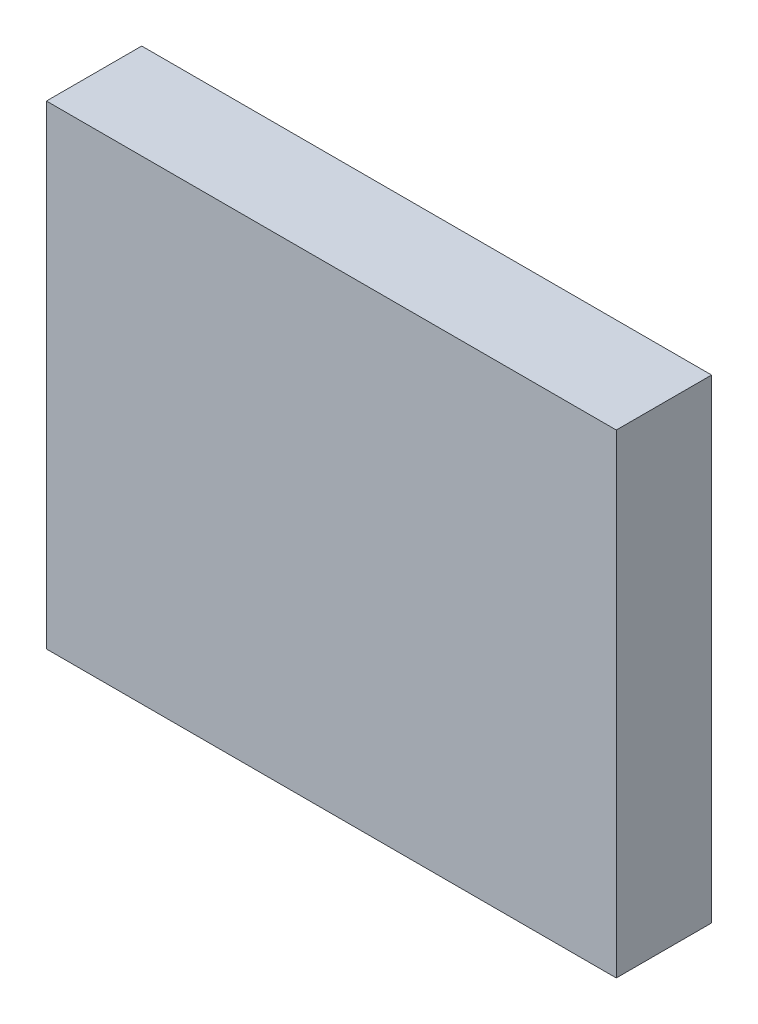
ISO-10303-21;
HEADER;
FILE_DESCRIPTION(('STEP AP214'),'2;1');
FILE_NAME('part.step','',(''),(''),'','','');
FILE_SCHEMA(('AUTOMOTIVE_DESIGN { 1 0 10303 214 1 1 1 1 }'));
ENDSEC;
DATA;
#1=APPLICATION_CONTEXT('core data for automotive mechanical design processes');
#2=APPLICATION_PROTOCOL_DEFINITION('international standard','automotive_design',2000,#1);
#3=PRODUCT_CONTEXT('',#1,'mechanical');
#4=PRODUCT('Part','Part','',(#3));
#5=PRODUCT_RELATED_PRODUCT_CATEGORY('part','',(#4));
#6=PRODUCT_DEFINITION_FORMATION('','',#4);
#7=PRODUCT_DEFINITION_CONTEXT('part definition',#1,'design');
#8=PRODUCT_DEFINITION('design','',#6,#7);
#9=PRODUCT_DEFINITION_SHAPE('','',#8);
#10=(LENGTH_UNIT() NAMED_UNIT(*) SI_UNIT(.MILLI.,.METRE.));
#11=(NAMED_UNIT(*) PLANE_ANGLE_UNIT() SI_UNIT($,.RADIAN.));
#12=(NAMED_UNIT(*) SI_UNIT($,.STERADIAN.) SOLID_ANGLE_UNIT());
#13=UNCERTAINTY_MEASURE_WITH_UNIT(LENGTH_MEASURE(1.E-05),#10,'distance_accuracy_value','');
#14=(GEOMETRIC_REPRESENTATION_CONTEXT(3) GLOBAL_UNCERTAINTY_ASSIGNED_CONTEXT((#13)) GLOBAL_UNIT_ASSIGNED_CONTEXT((#10,
#11,#12)) REPRESENTATION_CONTEXT('',''));
#15=CARTESIAN_POINT('',(0.,0.,0.));
#16=DIRECTION('',(0.,0.,1.));
#17=DIRECTION('',(1.,0.,0.));
#18=AXIS2_PLACEMENT_3D('',#15,#16,#17);
#19=CARTESIAN_POINT('',(-1.003,-0.127,0.));
#20=DIRECTION('',(0.,-1.,0.));
#21=DIRECTION('',(0.,0.,1.));
#22=AXIS2_PLACEMENT_3D('',#19,#20,#21);
#23=PLANE('',#22);
#24=DIRECTION('',(-1.,0.,0.));
#25=VECTOR('',#24,1.);
#26=CARTESIAN_POINT('',(-0.698,-0.127,0.));
#27=LINE('',#26,#25);
#28=CARTESIAN_POINT('',(-0.698,-0.127,0.));
#29=VERTEX_POINT('',#28);
#30=CARTESIAN_POINT('',(-1.003,-0.127,0.));
#31=VERTEX_POINT('',#30);
#32=EDGE_CURVE('E11',#29,#31,#27,.T.);
#33=ORIENTED_EDGE('',*,*,#32,.F.);
#34=DIRECTION('',(0.,0.,-1.));
#35=VECTOR('',#34,1.);
#36=CARTESIAN_POINT('',(-0.698,-0.127,0.051));
#37=LINE('',#36,#35);
#38=CARTESIAN_POINT('',(-0.698,-0.127,0.051));
#39=VERTEX_POINT('',#38);
#40=EDGE_CURVE('E24',#39,#29,#37,.T.);
#41=ORIENTED_EDGE('',*,*,#40,.F.);
#42=DIRECTION('',(1.,0.,0.));
#43=VECTOR('',#42,1.);
#44=CARTESIAN_POINT('',(-1.003,-0.127,0.051));
#45=LINE('',#44,#43);
#46=CARTESIAN_POINT('',(-1.003,-0.127,0.051));
#47=VERTEX_POINT('',#46);
#48=EDGE_CURVE('E88',#47,#39,#45,.T.);
#49=ORIENTED_EDGE('',*,*,#48,.F.);
#50=DIRECTION('',(0.,0.,1.));
#51=VECTOR('',#50,1.);
#52=CARTESIAN_POINT('',(-1.003,-0.127,0.));
#53=LINE('',#52,#51);
#54=EDGE_CURVE('E77',#31,#47,#53,.T.);
#55=ORIENTED_EDGE('',*,*,#54,.F.);
#56=EDGE_LOOP('',(#33,#41,#49,#55));
#57=FACE_BOUND('',#56,.T.);
#58=ADVANCED_FACE('F17',(#57),#23,.T.);
#59=CARTESIAN_POINT('',(-0.698,-0.127,0.));
#60=DIRECTION('',(1.,0.,0.));
#61=DIRECTION('',(0.,0.,1.));
#62=AXIS2_PLACEMENT_3D('',#59,#60,#61);
#63=PLANE('',#62);
#64=DIRECTION('',(0.,-1.,0.));
#65=VECTOR('',#64,1.);
#66=CARTESIAN_POINT('',(-0.698,0.127,0.));
#67=LINE('',#66,#65);
#68=CARTESIAN_POINT('',(-0.698,0.127,0.));
#69=VERTEX_POINT('',#68);
#70=EDGE_CURVE('E85',#69,#29,#67,.T.);
#71=ORIENTED_EDGE('',*,*,#70,.F.);
#72=DIRECTION('',(0.,0.,-1.));
#73=VECTOR('',#72,1.);
#74=CARTESIAN_POINT('',(-0.698,0.127,0.051));
#75=LINE('',#74,#73);
#76=CARTESIAN_POINT('',(-0.698,0.127,0.051));
#77=VERTEX_POINT('',#76);
#78=EDGE_CURVE('E83',#77,#69,#75,.T.);
#79=ORIENTED_EDGE('',*,*,#78,.F.);
#80=DIRECTION('',(0.,1.,0.));
#81=VECTOR('',#80,1.);
#82=CARTESIAN_POINT('',(-0.698,-0.127,0.051));
#83=LINE('',#82,#81);
#84=EDGE_CURVE('E72',#39,#77,#83,.T.);
#85=ORIENTED_EDGE('',*,*,#84,.F.);
#86=ORIENTED_EDGE('',*,*,#40,.T.);
#87=EDGE_LOOP('',(#71,#79,#85,#86));
#88=FACE_BOUND('',#87,.T.);
#89=ADVANCED_FACE('F90',(#88),#63,.T.);
#90=CARTESIAN_POINT('',(-0.698,0.127,0.));
#91=DIRECTION('',(0.,1.,0.));
#92=DIRECTION('',(0.,0.,1.));
#93=AXIS2_PLACEMENT_3D('',#90,#91,#92);
#94=PLANE('',#93);
#95=DIRECTION('',(1.,0.,0.));
#96=VECTOR('',#95,1.);
#97=CARTESIAN_POINT('',(-1.003,0.127,0.));
#98=LINE('',#97,#96);
#99=CARTESIAN_POINT('',(-1.003,0.127,0.));
#100=VERTEX_POINT('',#99);
#101=EDGE_CURVE('E60',#100,#69,#98,.T.);
#102=ORIENTED_EDGE('',*,*,#101,.F.);
#103=DIRECTION('',(0.,0.,-1.));
#104=VECTOR('',#103,1.);
#105=CARTESIAN_POINT('',(-1.003,0.127,0.051));
#106=LINE('',#105,#104);
#107=CARTESIAN_POINT('',(-1.003,0.127,0.051));
#108=VERTEX_POINT('',#107);
#109=EDGE_CURVE('E54',#108,#100,#106,.T.);
#110=ORIENTED_EDGE('',*,*,#109,.F.);
#111=DIRECTION('',(-1.,0.,0.));
#112=VECTOR('',#111,1.);
#113=CARTESIAN_POINT('',(-0.698,0.127,0.051));
#114=LINE('',#113,#112);
#115=EDGE_CURVE('E58',#77,#108,#114,.T.);
#116=ORIENTED_EDGE('',*,*,#115,.F.);
#117=ORIENTED_EDGE('',*,*,#78,.T.);
#118=EDGE_LOOP('',(#102,#110,#116,#117));
#119=FACE_BOUND('',#118,.T.);
#120=ADVANCED_FACE('F56',(#119),#94,.T.);
#121=CARTESIAN_POINT('',(-1.003,0.127,0.));
#122=DIRECTION('',(-1.,0.,0.));
#123=DIRECTION('',(0.,0.,1.));
#124=AXIS2_PLACEMENT_3D('',#121,#122,#123);
#125=PLANE('',#124);
#126=DIRECTION('',(0.,1.,0.));
#127=VECTOR('',#126,1.);
#128=CARTESIAN_POINT('',(-1.003,-0.127,0.));
#129=LINE('',#128,#127);
#130=EDGE_CURVE('E73',#31,#100,#129,.T.);
#131=ORIENTED_EDGE('',*,*,#130,.F.);
#132=ORIENTED_EDGE('',*,*,#54,.T.);
#133=DIRECTION('',(0.,-1.,0.));
#134=VECTOR('',#133,1.);
#135=CARTESIAN_POINT('',(-1.003,0.127,0.051));
#136=LINE('',#135,#134);
#137=EDGE_CURVE('E70',#108,#47,#136,.T.);
#138=ORIENTED_EDGE('',*,*,#137,.F.);
#139=ORIENTED_EDGE('',*,*,#109,.T.);
#140=EDGE_LOOP('',(#131,#132,#138,#139));
#141=FACE_BOUND('',#140,.T.);
#142=ADVANCED_FACE('F76',(#141),#125,.T.);
#143=CARTESIAN_POINT('',(-1.003,0.127,0.));
#144=DIRECTION('',(0.,0.,-1.));
#145=DIRECTION('',(0.,1.,0.));
#146=AXIS2_PLACEMENT_3D('',#143,#144,#145);
#147=PLANE('',#146);
#148=ORIENTED_EDGE('',*,*,#101,.T.);
#149=ORIENTED_EDGE('',*,*,#70,.T.);
#150=ORIENTED_EDGE('',*,*,#32,.T.);
#151=ORIENTED_EDGE('',*,*,#130,.T.);
#152=EDGE_LOOP('',(#148,#149,#150,#151));
#153=FACE_BOUND('',#152,.T.);
#154=ADVANCED_FACE('F91',(#153),#147,.T.);
#155=CARTESIAN_POINT('',(-1.003,-0.127,0.051));
#156=DIRECTION('',(0.,0.,1.));
#157=DIRECTION('',(0.,1.,0.));
#158=AXIS2_PLACEMENT_3D('',#155,#156,#157);
#159=PLANE('',#158);
#160=ORIENTED_EDGE('',*,*,#48,.T.);
#161=ORIENTED_EDGE('',*,*,#84,.T.);
#162=ORIENTED_EDGE('',*,*,#115,.T.);
#163=ORIENTED_EDGE('',*,*,#137,.T.);
#164=EDGE_LOOP('',(#160,#161,#162,#163));
#165=FACE_BOUND('',#164,.T.);
#166=ADVANCED_FACE('F69',(#165),#159,.T.);
#167=CLOSED_SHELL('',(#58,#89,#120,#142,#154,#166));
#168=MANIFOLD_SOLID_BREP('B1',#167);
#169=ADVANCED_BREP_SHAPE_REPRESENTATION('',(#18,#168),#14);
#170=SHAPE_DEFINITION_REPRESENTATION(#9,#169);
ENDSEC;
END-ISO-10303-21;
